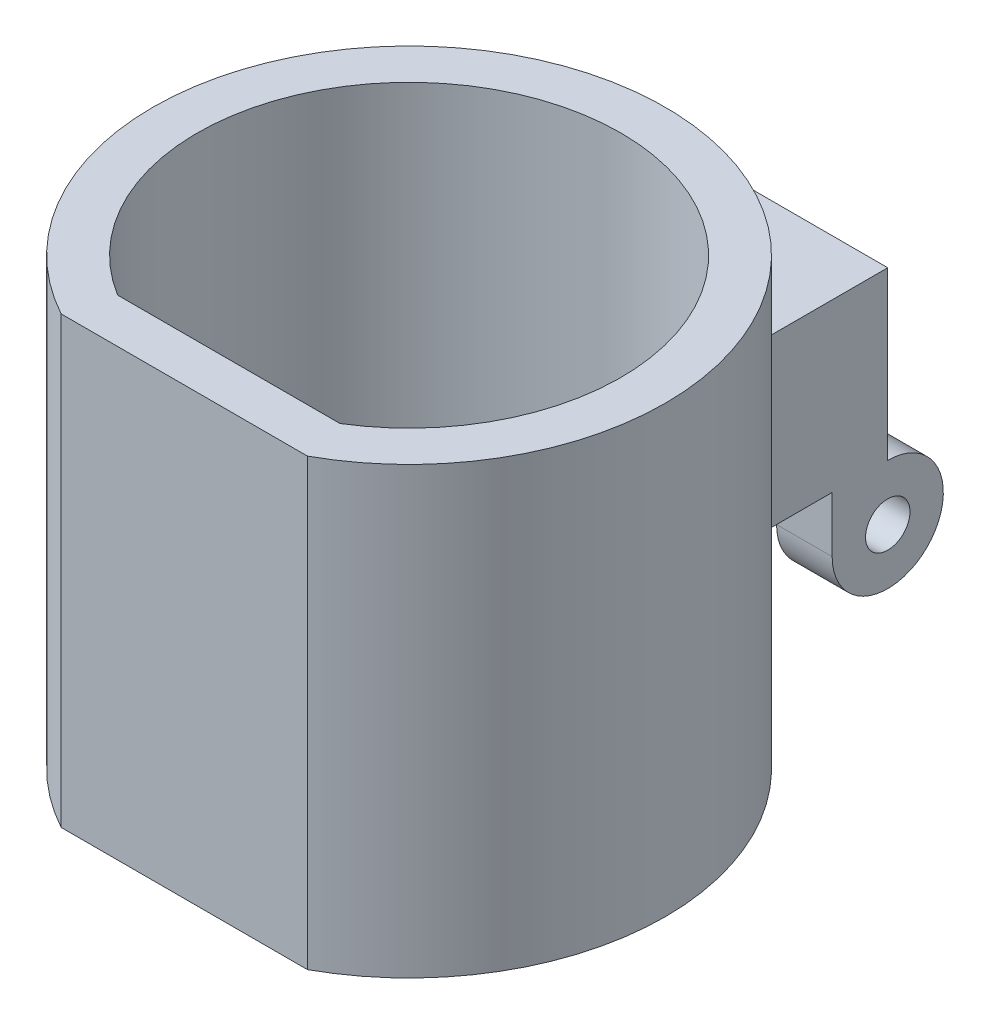
ISO-10303-21;
HEADER;
FILE_DESCRIPTION(('STEP AP214'),'2;1');
FILE_NAME('part.step','',(''),(''),'','','');
FILE_SCHEMA(('AUTOMOTIVE_DESIGN { 1 0 10303 214 1 1 1 1 }'));
ENDSEC;
DATA;
#1=APPLICATION_CONTEXT('core data for automotive mechanical design processes');
#2=APPLICATION_PROTOCOL_DEFINITION('international standard','automotive_design',2000,#1);
#3=PRODUCT_CONTEXT('',#1,'mechanical');
#4=PRODUCT('Part','Part','',(#3));
#5=PRODUCT_RELATED_PRODUCT_CATEGORY('part','',(#4));
#6=PRODUCT_DEFINITION_FORMATION('','',#4);
#7=PRODUCT_DEFINITION_CONTEXT('part definition',#1,'design');
#8=PRODUCT_DEFINITION('design','',#6,#7);
#9=PRODUCT_DEFINITION_SHAPE('','',#8);
#10=(LENGTH_UNIT() NAMED_UNIT(*) SI_UNIT(.MILLI.,.METRE.));
#11=(NAMED_UNIT(*) PLANE_ANGLE_UNIT() SI_UNIT($,.RADIAN.));
#12=(NAMED_UNIT(*) SI_UNIT($,.STERADIAN.) SOLID_ANGLE_UNIT());
#13=UNCERTAINTY_MEASURE_WITH_UNIT(LENGTH_MEASURE(1.E-05),#10,'distance_accuracy_value','');
#14=(GEOMETRIC_REPRESENTATION_CONTEXT(3) GLOBAL_UNCERTAINTY_ASSIGNED_CONTEXT((#13)) GLOBAL_UNIT_ASSIGNED_CONTEXT((#10,
#11,#12)) REPRESENTATION_CONTEXT('',''));
#15=CARTESIAN_POINT('',(0.,0.,0.));
#16=DIRECTION('',(0.,0.,1.));
#17=DIRECTION('',(1.,0.,0.));
#18=AXIS2_PLACEMENT_3D('',#15,#16,#17);
#19=CARTESIAN_POINT('',(10.,-7.5,-33.05));
#20=DIRECTION('',(0.,1.,0.));
#21=DIRECTION('',(0.,0.,1.));
#22=AXIS2_PLACEMENT_3D('',#19,#20,#21);
#23=PLANE('',#22);
#24=DIRECTION('',(0.,0.,1.));
#25=VECTOR('',#24,1.);
#26=CARTESIAN_POINT('',(-5.,-7.5,-28.05));
#27=LINE('',#26,#25);
#28=CARTESIAN_POINT('',(-5.,-7.5,-33.05));
#29=VERTEX_POINT('',#28);
#30=CARTESIAN_POINT('',(-5.,-7.5,-28.05));
#31=VERTEX_POINT('',#30);
#32=EDGE_CURVE('E140',#29,#31,#27,.T.);
#33=ORIENTED_EDGE('',*,*,#32,.F.);
#34=DIRECTION('',(-1.,0.,0.));
#35=VECTOR('',#34,1.);
#36=CARTESIAN_POINT('',(10.,-7.5,-33.05));
#37=LINE('',#36,#35);
#38=CARTESIAN_POINT('',(5.,-7.5,-33.05));
#39=VERTEX_POINT('',#38);
#40=EDGE_CURVE('E210',#39,#29,#37,.T.);
#41=ORIENTED_EDGE('',*,*,#40,.F.);
#42=DIRECTION('',(0.,0.,1.));
#43=VECTOR('',#42,1.);
#44=CARTESIAN_POINT('',(5.,-7.5,-28.05));
#45=LINE('',#44,#43);
#46=CARTESIAN_POINT('',(5.,-7.5,-28.05));
#47=VERTEX_POINT('',#46);
#48=EDGE_CURVE('E176',#39,#47,#45,.T.);
#49=ORIENTED_EDGE('',*,*,#48,.T.);
#50=DIRECTION('',(1.,0.,0.));
#51=VECTOR('',#50,1.);
#52=CARTESIAN_POINT('',(5.,-7.5,-28.05));
#53=LINE('',#52,#51);
#54=CARTESIAN_POINT('',(10.,-7.5,-28.05));
#55=VERTEX_POINT('',#54);
#56=EDGE_CURVE('E183',#47,#55,#53,.T.);
#57=ORIENTED_EDGE('',*,*,#56,.T.);
#58=DIRECTION('',(0.,0.,1.));
#59=VECTOR('',#58,1.);
#60=CARTESIAN_POINT('',(10.,-7.5,-33.05));
#61=LINE('',#60,#59);
#62=CARTESIAN_POINT('',(10.,-7.5,-20.7678236702838));
#63=VERTEX_POINT('',#62);
#64=EDGE_CURVE('E216',#55,#63,#61,.T.);
#65=ORIENTED_EDGE('',*,*,#64,.T.);
#66=CARTESIAN_POINT('',(0.,-7.5,0.));
#67=DIRECTION('',(0.,-1.,0.));
#68=DIRECTION('',(0.,0.,-1.));
#69=AXIS2_PLACEMENT_3D('',#66,#67,#68);
#70=CIRCLE('',#69,23.05);
#71=CARTESIAN_POINT('',(-10.,-7.5,-20.7678236702838));
#72=VERTEX_POINT('',#71);
#73=EDGE_CURVE('E195',#63,#72,#70,.F.);
#74=ORIENTED_EDGE('',*,*,#73,.T.);
#75=DIRECTION('',(0.,0.,1.));
#76=VECTOR('',#75,1.);
#77=CARTESIAN_POINT('',(-10.,-7.5,-33.05));
#78=LINE('',#77,#76);
#79=CARTESIAN_POINT('',(-10.,-7.5,-28.05));
#80=VERTEX_POINT('',#79);
#81=EDGE_CURVE('E214',#80,#72,#78,.T.);
#82=ORIENTED_EDGE('',*,*,#81,.F.);
#83=DIRECTION('',(-1.,0.,0.));
#84=VECTOR('',#83,1.);
#85=CARTESIAN_POINT('',(-5.,-7.5,-28.05));
#86=LINE('',#85,#84);
#87=EDGE_CURVE('E151',#31,#80,#86,.T.);
#88=ORIENTED_EDGE('',*,*,#87,.F.);
#89=EDGE_LOOP('',(#33,#41,#49,#57,#65,#74,#82,#88));
#90=FACE_BOUND('',#89,.T.);
#91=ADVANCED_FACE('F37',(#90),#23,.F.);
#92=CARTESIAN_POINT('',(0.,20.,0.));
#93=DIRECTION('',(0.,-1.,0.));
#94=DIRECTION('',(0.,0.,-1.));
#95=AXIS2_PLACEMENT_3D('',#92,#93,#94);
#96=CYLINDRICAL_SURFACE('',#95,23.05);
#97=CARTESIAN_POINT('',(0.,-20.,0.));
#98=DIRECTION('',(0.,1.,0.));
#99=DIRECTION('',(0.,0.,1.));
#100=AXIS2_PLACEMENT_3D('',#97,#98,#99);
#101=CIRCLE('',#100,23.05);
#102=CARTESIAN_POINT('',(11.076364599346,-20.,20.2142684077944));
#103=VERTEX_POINT('',#102);
#104=CARTESIAN_POINT('',(-11.076364599346,-20.,20.2142684077944));
#105=VERTEX_POINT('',#104);
#106=EDGE_CURVE('E240',#103,#105,#101,.T.);
#107=ORIENTED_EDGE('',*,*,#106,.T.);
#108=DIRECTION('',(0.,-1.,0.));
#109=VECTOR('',#108,1.);
#110=CARTESIAN_POINT('',(-11.076364599346,20.,20.2142684077944));
#111=LINE('',#110,#109);
#112=CARTESIAN_POINT('',(-11.076364599346,20.,20.2142684077944));
#113=VERTEX_POINT('',#112);
#114=EDGE_CURVE('E11',#113,#105,#111,.T.);
#115=ORIENTED_EDGE('',*,*,#114,.F.);
#116=CARTESIAN_POINT('',(0.,20.,0.));
#117=DIRECTION('',(0.,1.,0.));
#118=DIRECTION('',(0.,0.,1.));
#119=AXIS2_PLACEMENT_3D('',#116,#117,#118);
#120=CIRCLE('',#119,23.05);
#121=CARTESIAN_POINT('',(11.076364599346,20.,20.2142684077944));
#122=VERTEX_POINT('',#121);
#123=EDGE_CURVE('E241',#122,#113,#120,.T.);
#124=ORIENTED_EDGE('',*,*,#123,.F.);
#125=DIRECTION('',(0.,-1.,0.));
#126=VECTOR('',#125,1.);
#127=CARTESIAN_POINT('',(11.076364599346,20.,20.2142684077944));
#128=LINE('',#127,#126);
#129=EDGE_CURVE('E45',#122,#103,#128,.T.);
#130=ORIENTED_EDGE('',*,*,#129,.T.);
#131=EDGE_LOOP('',(#107,#115,#124,#130));
#132=FACE_BOUND('',#131,.T.);
#133=DIRECTION('',(0.,-1.,0.));
#134=VECTOR('',#133,1.);
#135=CARTESIAN_POINT('',(-10.,20.,-20.7678236702838));
#136=LINE('',#135,#134);
#137=CARTESIAN_POINT('',(-10.,7.5,-20.7678236702838));
#138=VERTEX_POINT('',#137);
#139=EDGE_CURVE('E190',#72,#138,#136,.F.);
#140=ORIENTED_EDGE('',*,*,#139,.F.);
#141=ORIENTED_EDGE('',*,*,#73,.F.);
#142=DIRECTION('',(0.,-1.,0.));
#143=VECTOR('',#142,1.);
#144=CARTESIAN_POINT('',(10.,20.,-20.7678236702838));
#145=LINE('',#144,#143);
#146=CARTESIAN_POINT('',(10.,7.5,-20.7678236702838));
#147=VERTEX_POINT('',#146);
#148=EDGE_CURVE('E199',#147,#63,#145,.T.);
#149=ORIENTED_EDGE('',*,*,#148,.F.);
#150=CARTESIAN_POINT('',(0.,7.5,0.));
#151=DIRECTION('',(0.,1.,0.));
#152=DIRECTION('',(0.,0.,1.));
#153=AXIS2_PLACEMENT_3D('',#150,#151,#152);
#154=CIRCLE('',#153,23.05);
#155=EDGE_CURVE('E60',#138,#147,#154,.F.);
#156=ORIENTED_EDGE('',*,*,#155,.F.);
#157=EDGE_LOOP('',(#140,#141,#149,#156));
#158=FACE_BOUND('',#157,.T.);
#159=ADVANCED_FACE('F39',(#132,#158),#96,.T.);
#160=CARTESIAN_POINT('',(0.,20.,0.));
#161=DIRECTION('',(0.,1.,0.));
#162=DIRECTION('',(0.,0.,1.));
#163=AXIS2_PLACEMENT_3D('',#160,#161,#162);
#164=PLANE('',#163);
#165=ORIENTED_EDGE('',*,*,#123,.T.);
#166=DIRECTION('',(1.,0.,0.));
#167=VECTOR('',#166,1.);
#168=CARTESIAN_POINT('',(-11.076364599346,20.,20.2142684077944));
#169=LINE('',#168,#167);
#170=EDGE_CURVE('E244',#113,#122,#169,.T.);
#171=ORIENTED_EDGE('',*,*,#170,.T.);
#172=EDGE_LOOP('',(#165,#171));
#173=FACE_BOUND('',#172,.T.);
#174=DIRECTION('',(1.,0.,0.));
#175=VECTOR('',#174,1.);
#176=CARTESIAN_POINT('',(-10.,20.,16.2142684077944));
#177=LINE('',#176,#175);
#178=CARTESIAN_POINT('',(-10.,20.,16.2142684077944));
#179=VERTEX_POINT('',#178);
#180=CARTESIAN_POINT('',(10.,20.,16.2142684077944));
#181=VERTEX_POINT('',#180);
#182=EDGE_CURVE('E227',#179,#181,#177,.T.);
#183=ORIENTED_EDGE('',*,*,#182,.F.);
#184=CARTESIAN_POINT('',(0.,20.,0.));
#185=DIRECTION('',(0.,1.,0.));
#186=DIRECTION('',(0.,0.,1.));
#187=AXIS2_PLACEMENT_3D('',#184,#185,#186);
#188=CIRCLE('',#187,19.05);
#189=EDGE_CURVE('E224',#181,#179,#188,.T.);
#190=ORIENTED_EDGE('',*,*,#189,.F.);
#191=EDGE_LOOP('',(#183,#190));
#192=FACE_BOUND('',#191,.T.);
#193=ADVANCED_FACE('F261',(#173,#192),#164,.T.);
#194=CARTESIAN_POINT('',(0.,-20.,0.));
#195=DIRECTION('',(0.,1.,0.));
#196=DIRECTION('',(0.,0.,1.));
#197=AXIS2_PLACEMENT_3D('',#194,#195,#196);
#198=PLANE('',#197);
#199=ORIENTED_EDGE('',*,*,#106,.F.);
#200=DIRECTION('',(1.,0.,0.));
#201=VECTOR('',#200,1.);
#202=CARTESIAN_POINT('',(-11.076364599346,-20.,20.2142684077944));
#203=LINE('',#202,#201);
#204=EDGE_CURVE('E245',#105,#103,#203,.T.);
#205=ORIENTED_EDGE('',*,*,#204,.F.);
#206=EDGE_LOOP('',(#199,#205));
#207=FACE_BOUND('',#206,.T.);
#208=CARTESIAN_POINT('',(0.,-20.,0.));
#209=DIRECTION('',(0.,1.,0.));
#210=DIRECTION('',(0.,0.,1.));
#211=AXIS2_PLACEMENT_3D('',#208,#209,#210);
#212=CIRCLE('',#211,19.05);
#213=CARTESIAN_POINT('',(10.,-20.,16.2142684077944));
#214=VERTEX_POINT('',#213);
#215=CARTESIAN_POINT('',(-10.,-20.,16.2142684077944));
#216=VERTEX_POINT('',#215);
#217=EDGE_CURVE('E223',#214,#216,#212,.T.);
#218=ORIENTED_EDGE('',*,*,#217,.T.);
#219=DIRECTION('',(1.,0.,0.));
#220=VECTOR('',#219,1.);
#221=CARTESIAN_POINT('',(-10.,-20.,16.2142684077944));
#222=LINE('',#221,#220);
#223=EDGE_CURVE('E228',#216,#214,#222,.T.);
#224=ORIENTED_EDGE('',*,*,#223,.T.);
#225=EDGE_LOOP('',(#218,#224));
#226=FACE_BOUND('',#225,.T.);
#227=ADVANCED_FACE('F257',(#207,#226),#198,.F.);
#228=CARTESIAN_POINT('',(-11.076364599346,20.,20.2142684077944));
#229=DIRECTION('',(0.,0.,-1.));
#230=DIRECTION('',(-1.,0.,0.));
#231=AXIS2_PLACEMENT_3D('',#228,#229,#230);
#232=PLANE('',#231);
#233=ORIENTED_EDGE('',*,*,#204,.T.);
#234=ORIENTED_EDGE('',*,*,#129,.F.);
#235=ORIENTED_EDGE('',*,*,#170,.F.);
#236=ORIENTED_EDGE('',*,*,#114,.T.);
#237=EDGE_LOOP('',(#233,#234,#235,#236));
#238=FACE_BOUND('',#237,.T.);
#239=ADVANCED_FACE('F259',(#238),#232,.F.);
#240=CARTESIAN_POINT('',(0.,20.,0.));
#241=DIRECTION('',(0.,-1.,0.));
#242=DIRECTION('',(0.,0.,-1.));
#243=AXIS2_PLACEMENT_3D('',#240,#241,#242);
#244=CYLINDRICAL_SURFACE('',#243,19.05);
#245=ORIENTED_EDGE('',*,*,#217,.F.);
#246=DIRECTION('',(0.,-1.,0.));
#247=VECTOR('',#246,1.);
#248=CARTESIAN_POINT('',(10.,20.,16.2142684077944));
#249=LINE('',#248,#247);
#250=EDGE_CURVE('E230',#181,#214,#249,.T.);
#251=ORIENTED_EDGE('',*,*,#250,.F.);
#252=ORIENTED_EDGE('',*,*,#189,.T.);
#253=DIRECTION('',(0.,-1.,0.));
#254=VECTOR('',#253,1.);
#255=CARTESIAN_POINT('',(-10.,20.,16.2142684077944));
#256=LINE('',#255,#254);
#257=EDGE_CURVE('E237',#179,#216,#256,.T.);
#258=ORIENTED_EDGE('',*,*,#257,.T.);
#259=EDGE_LOOP('',(#245,#251,#252,#258));
#260=FACE_BOUND('',#259,.T.);
#261=ADVANCED_FACE('F271',(#260),#244,.F.);
#262=CARTESIAN_POINT('',(-10.,20.,16.2142684077944));
#263=DIRECTION('',(0.,0.,-1.));
#264=DIRECTION('',(-1.,0.,0.));
#265=AXIS2_PLACEMENT_3D('',#262,#263,#264);
#266=PLANE('',#265);
#267=ORIENTED_EDGE('',*,*,#223,.F.);
#268=ORIENTED_EDGE('',*,*,#257,.F.);
#269=ORIENTED_EDGE('',*,*,#182,.T.);
#270=ORIENTED_EDGE('',*,*,#250,.T.);
#271=EDGE_LOOP('',(#267,#268,#269,#270));
#272=FACE_BOUND('',#271,.T.);
#273=ADVANCED_FACE('F269',(#272),#266,.T.);
#274=CARTESIAN_POINT('',(-10.,-7.5,-33.05));
#275=DIRECTION('',(1.,0.,0.));
#276=DIRECTION('',(0.,0.,-1.));
#277=AXIS2_PLACEMENT_3D('',#274,#275,#276);
#278=PLANE('',#277);
#279=DIRECTION('',(0.,1.,0.));
#280=VECTOR('',#279,1.);
#281=CARTESIAN_POINT('',(-10.,-7.5,-33.05));
#282=LINE('',#281,#280);
#283=CARTESIAN_POINT('',(-10.,-7.5,-33.05));
#284=VERTEX_POINT('',#283);
#285=CARTESIAN_POINT('',(-10.,7.5,-33.05));
#286=VERTEX_POINT('',#285);
#287=EDGE_CURVE('E198',#284,#286,#282,.T.);
#288=ORIENTED_EDGE('',*,*,#287,.F.);
#289=CARTESIAN_POINT('',(-10.,-12.5,-33.05));
#290=DIRECTION('',(1.,0.,0.));
#291=DIRECTION('',(0.,0.,-1.));
#292=AXIS2_PLACEMENT_3D('',#289,#290,#291);
#293=CIRCLE('',#292,5.);
#294=CARTESIAN_POINT('',(-10.,-12.5,-28.05));
#295=VERTEX_POINT('',#294);
#296=EDGE_CURVE('E157',#295,#284,#293,.T.);
#297=ORIENTED_EDGE('',*,*,#296,.F.);
#298=DIRECTION('',(0.,-1.,0.));
#299=VECTOR('',#298,1.);
#300=CARTESIAN_POINT('',(-10.,-12.5,-28.05));
#301=LINE('',#300,#299);
#302=EDGE_CURVE('E148',#80,#295,#301,.T.);
#303=ORIENTED_EDGE('',*,*,#302,.F.);
#304=ORIENTED_EDGE('',*,*,#81,.T.);
#305=ORIENTED_EDGE('',*,*,#139,.T.);
#306=DIRECTION('',(0.,0.,1.));
#307=VECTOR('',#306,1.);
#308=CARTESIAN_POINT('',(-10.,7.5,-33.05));
#309=LINE('',#308,#307);
#310=EDGE_CURVE('E221',#286,#138,#309,.T.);
#311=ORIENTED_EDGE('',*,*,#310,.F.);
#312=EDGE_LOOP('',(#288,#297,#303,#304,#305,#311));
#313=FACE_BOUND('',#312,.T.);
#314=CARTESIAN_POINT('',(-10.,-12.5,-33.05));
#315=DIRECTION('',(1.,0.,0.));
#316=DIRECTION('',(0.,0.,-1.));
#317=AXIS2_PLACEMENT_3D('',#314,#315,#316);
#318=CIRCLE('',#317,2.);
#319=CARTESIAN_POINT('',(-10.,-12.5,-35.05));
#320=VERTEX_POINT('',#319);
#321=EDGE_CURVE('E160',#320,#320,#318,.T.);
#322=ORIENTED_EDGE('',*,*,#321,.T.);
#323=EDGE_LOOP('',(#322));
#324=FACE_BOUND('',#323,.T.);
#325=ADVANCED_FACE('F294',(#313,#324),#278,.F.);
#326=CARTESIAN_POINT('',(10.,7.5,-33.05));
#327=DIRECTION('',(0.,-1.,0.));
#328=DIRECTION('',(0.,0.,-1.));
#329=AXIS2_PLACEMENT_3D('',#326,#327,#328);
#330=PLANE('',#329);
#331=ORIENTED_EDGE('',*,*,#310,.T.);
#332=ORIENTED_EDGE('',*,*,#155,.T.);
#333=DIRECTION('',(0.,0.,1.));
#334=VECTOR('',#333,1.);
#335=CARTESIAN_POINT('',(10.,7.5,-33.05));
#336=LINE('',#335,#334);
#337=CARTESIAN_POINT('',(10.,7.5,-33.05));
#338=VERTEX_POINT('',#337);
#339=EDGE_CURVE('E218',#338,#147,#336,.T.);
#340=ORIENTED_EDGE('',*,*,#339,.F.);
#341=DIRECTION('',(1.,0.,0.));
#342=VECTOR('',#341,1.);
#343=CARTESIAN_POINT('',(10.,7.5,-33.05));
#344=LINE('',#343,#342);
#345=EDGE_CURVE('E205',#286,#338,#344,.T.);
#346=ORIENTED_EDGE('',*,*,#345,.F.);
#347=EDGE_LOOP('',(#331,#332,#340,#346));
#348=FACE_BOUND('',#347,.T.);
#349=ADVANCED_FACE('F290',(#348),#330,.F.);
#350=CARTESIAN_POINT('',(10.,-7.5,-33.05));
#351=DIRECTION('',(-1.,0.,0.));
#352=DIRECTION('',(0.,0.,1.));
#353=AXIS2_PLACEMENT_3D('',#350,#351,#352);
#354=PLANE('',#353);
#355=ORIENTED_EDGE('',*,*,#339,.T.);
#356=ORIENTED_EDGE('',*,*,#148,.T.);
#357=ORIENTED_EDGE('',*,*,#64,.F.);
#358=DIRECTION('',(0.,-1.,0.));
#359=VECTOR('',#358,1.);
#360=CARTESIAN_POINT('',(10.,-12.5,-28.05));
#361=LINE('',#360,#359);
#362=CARTESIAN_POINT('',(10.,-12.5,-28.05));
#363=VERTEX_POINT('',#362);
#364=EDGE_CURVE('E177',#55,#363,#361,.T.);
#365=ORIENTED_EDGE('',*,*,#364,.T.);
#366=CARTESIAN_POINT('',(10.,-12.5,-33.05));
#367=DIRECTION('',(1.,0.,0.));
#368=DIRECTION('',(0.,0.,-1.));
#369=AXIS2_PLACEMENT_3D('',#366,#367,#368);
#370=CIRCLE('',#369,5.);
#371=CARTESIAN_POINT('',(10.,-7.5,-33.05));
#372=VERTEX_POINT('',#371);
#373=EDGE_CURVE('E172',#363,#372,#370,.T.);
#374=ORIENTED_EDGE('',*,*,#373,.T.);
#375=DIRECTION('',(0.,-1.,0.));
#376=VECTOR('',#375,1.);
#377=CARTESIAN_POINT('',(10.,-7.5,-33.05));
#378=LINE('',#377,#376);
#379=EDGE_CURVE('E207',#338,#372,#378,.T.);
#380=ORIENTED_EDGE('',*,*,#379,.F.);
#381=EDGE_LOOP('',(#355,#356,#357,#365,#374,#380));
#382=FACE_BOUND('',#381,.T.);
#383=CARTESIAN_POINT('',(10.,-12.5,-33.05));
#384=DIRECTION('',(1.,0.,0.));
#385=DIRECTION('',(0.,0.,-1.));
#386=AXIS2_PLACEMENT_3D('',#383,#384,#385);
#387=CIRCLE('',#386,2.);
#388=CARTESIAN_POINT('',(10.,-12.5,-35.05));
#389=VERTEX_POINT('',#388);
#390=EDGE_CURVE('E167',#389,#389,#387,.T.);
#391=ORIENTED_EDGE('',*,*,#390,.F.);
#392=EDGE_LOOP('',(#391));
#393=FACE_BOUND('',#392,.T.);
#394=ADVANCED_FACE('F287',(#382,#393),#354,.F.);
#395=CARTESIAN_POINT('',(0.,0.,-33.05));
#396=DIRECTION('',(0.,0.,1.));
#397=DIRECTION('',(1.,0.,0.));
#398=AXIS2_PLACEMENT_3D('',#395,#396,#397);
#399=PLANE('',#398);
#400=ORIENTED_EDGE('',*,*,#287,.T.);
#401=ORIENTED_EDGE('',*,*,#345,.T.);
#402=ORIENTED_EDGE('',*,*,#379,.T.);
#403=EDGE_CURVE('E211',#372,#39,#37,.T.);
#404=ORIENTED_EDGE('',*,*,#403,.T.);
#405=ORIENTED_EDGE('',*,*,#40,.T.);
#406=DIRECTION('',(-1.,0.,0.));
#407=VECTOR('',#406,1.);
#408=CARTESIAN_POINT('',(-5.,-7.5,-33.05));
#409=LINE('',#408,#407);
#410=EDGE_CURVE('E155',#29,#284,#409,.T.);
#411=ORIENTED_EDGE('',*,*,#410,.T.);
#412=EDGE_LOOP('',(#400,#401,#402,#404,#405,#411));
#413=FACE_BOUND('',#412,.T.);
#414=ADVANCED_FACE('F285',(#413),#399,.F.);
#415=CARTESIAN_POINT('',(5.,-12.5,-33.05));
#416=DIRECTION('',(1.,0.,0.));
#417=DIRECTION('',(0.,0.,-1.));
#418=AXIS2_PLACEMENT_3D('',#415,#416,#417);
#419=CYLINDRICAL_SURFACE('',#418,5.);
#420=ORIENTED_EDGE('',*,*,#373,.F.);
#421=DIRECTION('',(1.,0.,0.));
#422=VECTOR('',#421,1.);
#423=CARTESIAN_POINT('',(5.,-12.5,-28.05));
#424=LINE('',#423,#422);
#425=CARTESIAN_POINT('',(5.,-12.5,-28.05));
#426=VERTEX_POINT('',#425);
#427=EDGE_CURVE('E188',#426,#363,#424,.T.);
#428=ORIENTED_EDGE('',*,*,#427,.F.);
#429=CARTESIAN_POINT('',(5.,-12.5,-33.05));
#430=DIRECTION('',(1.,0.,0.));
#431=DIRECTION('',(0.,0.,-1.));
#432=AXIS2_PLACEMENT_3D('',#429,#430,#431);
#433=CIRCLE('',#432,5.);
#434=EDGE_CURVE('E52',#426,#39,#433,.T.);
#435=ORIENTED_EDGE('',*,*,#434,.T.);
#436=ORIENTED_EDGE('',*,*,#403,.F.);
#437=EDGE_LOOP('',(#420,#428,#435,#436));
#438=FACE_BOUND('',#437,.T.);
#439=ADVANCED_FACE('F330',(#438),#419,.T.);
#440=CARTESIAN_POINT('',(5.,-12.5,-28.05));
#441=DIRECTION('',(0.,0.,1.));
#442=DIRECTION('',(1.,0.,0.));
#443=AXIS2_PLACEMENT_3D('',#440,#441,#442);
#444=PLANE('',#443);
#445=ORIENTED_EDGE('',*,*,#364,.F.);
#446=ORIENTED_EDGE('',*,*,#56,.F.);
#447=DIRECTION('',(0.,-1.,0.));
#448=VECTOR('',#447,1.);
#449=CARTESIAN_POINT('',(5.,-12.5,-28.05));
#450=LINE('',#449,#448);
#451=EDGE_CURVE('E180',#47,#426,#450,.T.);
#452=ORIENTED_EDGE('',*,*,#451,.T.);
#453=ORIENTED_EDGE('',*,*,#427,.T.);
#454=EDGE_LOOP('',(#445,#446,#452,#453));
#455=FACE_BOUND('',#454,.T.);
#456=ADVANCED_FACE('F337',(#455),#444,.T.);
#457=CARTESIAN_POINT('',(5.,-12.5,-33.05));
#458=DIRECTION('',(1.,0.,0.));
#459=DIRECTION('',(0.,0.,-1.));
#460=AXIS2_PLACEMENT_3D('',#457,#458,#459);
#461=PLANE('',#460);
#462=CARTESIAN_POINT('',(5.,-12.5,-33.05));
#463=DIRECTION('',(1.,0.,0.));
#464=DIRECTION('',(0.,0.,-1.));
#465=AXIS2_PLACEMENT_3D('',#462,#463,#464);
#466=CIRCLE('',#465,2.);
#467=CARTESIAN_POINT('',(5.,-12.5,-35.05));
#468=VERTEX_POINT('',#467);
#469=EDGE_CURVE('E169',#468,#468,#466,.T.);
#470=ORIENTED_EDGE('',*,*,#469,.T.);
#471=EDGE_LOOP('',(#470));
#472=FACE_BOUND('',#471,.T.);
#473=ORIENTED_EDGE('',*,*,#434,.F.);
#474=ORIENTED_EDGE('',*,*,#451,.F.);
#475=ORIENTED_EDGE('',*,*,#48,.F.);
#476=EDGE_LOOP('',(#473,#474,#475));
#477=FACE_BOUND('',#476,.T.);
#478=ADVANCED_FACE('F343',(#472,#477),#461,.F.);
#479=CARTESIAN_POINT('',(5.,-12.5,-33.05));
#480=DIRECTION('',(1.,0.,0.));
#481=DIRECTION('',(0.,0.,-1.));
#482=AXIS2_PLACEMENT_3D('',#479,#480,#481);
#483=CYLINDRICAL_SURFACE('',#482,2.);
#484=ORIENTED_EDGE('',*,*,#469,.F.);
#485=EDGE_LOOP('',(#484));
#486=FACE_BOUND('',#485,.T.);
#487=ORIENTED_EDGE('',*,*,#390,.T.);
#488=EDGE_LOOP('',(#487));
#489=FACE_BOUND('',#488,.T.);
#490=ADVANCED_FACE('F351',(#486,#489),#483,.F.);
#491=CARTESIAN_POINT('',(-5.,-12.5,-33.05));
#492=DIRECTION('',(-1.,0.,0.));
#493=DIRECTION('',(0.,0.,-1.));
#494=AXIS2_PLACEMENT_3D('',#491,#492,#493);
#495=PLANE('',#494);
#496=CARTESIAN_POINT('',(-5.,-12.5,-33.05));
#497=DIRECTION('',(1.,0.,0.));
#498=DIRECTION('',(0.,0.,-1.));
#499=AXIS2_PLACEMENT_3D('',#496,#497,#498);
#500=CIRCLE('',#499,5.);
#501=CARTESIAN_POINT('',(-5.,-12.5,-28.05));
#502=VERTEX_POINT('',#501);
#503=EDGE_CURVE('E137',#502,#29,#500,.T.);
#504=ORIENTED_EDGE('',*,*,#503,.T.);
#505=ORIENTED_EDGE('',*,*,#32,.T.);
#506=DIRECTION('',(0.,-1.,0.));
#507=VECTOR('',#506,1.);
#508=CARTESIAN_POINT('',(-5.,-12.5,-28.05));
#509=LINE('',#508,#507);
#510=EDGE_CURVE('E132',#31,#502,#509,.T.);
#511=ORIENTED_EDGE('',*,*,#510,.T.);
#512=EDGE_LOOP('',(#504,#505,#511));
#513=FACE_BOUND('',#512,.T.);
#514=CARTESIAN_POINT('',(-5.,-12.5,-33.05));
#515=DIRECTION('',(1.,0.,0.));
#516=DIRECTION('',(0.,0.,-1.));
#517=AXIS2_PLACEMENT_3D('',#514,#515,#516);
#518=CIRCLE('',#517,2.);
#519=CARTESIAN_POINT('',(-5.,-12.5,-35.05));
#520=VERTEX_POINT('',#519);
#521=EDGE_CURVE('E164',#520,#520,#518,.T.);
#522=ORIENTED_EDGE('',*,*,#521,.F.);
#523=EDGE_LOOP('',(#522));
#524=FACE_BOUND('',#523,.T.);
#525=ADVANCED_FACE('F134',(#513,#524),#495,.F.);
#526=CARTESIAN_POINT('',(-5.,-12.5,-33.05));
#527=DIRECTION('',(-1.,0.,0.));
#528=DIRECTION('',(0.,0.,1.));
#529=AXIS2_PLACEMENT_3D('',#526,#527,#528);
#530=CYLINDRICAL_SURFACE('',#529,5.);
#531=ORIENTED_EDGE('',*,*,#296,.T.);
#532=ORIENTED_EDGE('',*,*,#410,.F.);
#533=ORIENTED_EDGE('',*,*,#503,.F.);
#534=DIRECTION('',(-1.,0.,0.));
#535=VECTOR('',#534,1.);
#536=CARTESIAN_POINT('',(-5.,-12.5,-28.05));
#537=LINE('',#536,#535);
#538=EDGE_CURVE('E145',#502,#295,#537,.T.);
#539=ORIENTED_EDGE('',*,*,#538,.T.);
#540=EDGE_LOOP('',(#531,#532,#533,#539));
#541=FACE_BOUND('',#540,.T.);
#542=ADVANCED_FACE('F153',(#541),#530,.T.);
#543=CARTESIAN_POINT('',(-5.,-12.5,-28.05));
#544=DIRECTION('',(0.,0.,-1.));
#545=DIRECTION('',(-1.,0.,0.));
#546=AXIS2_PLACEMENT_3D('',#543,#544,#545);
#547=PLANE('',#546);
#548=ORIENTED_EDGE('',*,*,#302,.T.);
#549=ORIENTED_EDGE('',*,*,#538,.F.);
#550=ORIENTED_EDGE('',*,*,#510,.F.);
#551=ORIENTED_EDGE('',*,*,#87,.T.);
#552=EDGE_LOOP('',(#548,#549,#550,#551));
#553=FACE_BOUND('',#552,.T.);
#554=ADVANCED_FACE('F146',(#553),#547,.F.);
#555=CARTESIAN_POINT('',(-5.,-12.5,-33.05));
#556=DIRECTION('',(-1.,0.,0.));
#557=DIRECTION('',(0.,0.,1.));
#558=AXIS2_PLACEMENT_3D('',#555,#556,#557);
#559=CYLINDRICAL_SURFACE('',#558,2.);
#560=ORIENTED_EDGE('',*,*,#521,.T.);
#561=EDGE_LOOP('',(#560));
#562=FACE_BOUND('',#561,.T.);
#563=ORIENTED_EDGE('',*,*,#321,.F.);
#564=EDGE_LOOP('',(#563));
#565=FACE_BOUND('',#564,.T.);
#566=ADVANCED_FACE('F377',(#562,#565),#559,.F.);
#567=CLOSED_SHELL('',(#91,#159,#193,#227,#239,#261,#273,#325,#349,#394,#414,#439,#456,#478,#490,
#525,#542,#554,#566));
#568=MANIFOLD_SOLID_BREP('B2',#567);
#569=ADVANCED_BREP_SHAPE_REPRESENTATION('',(#18,#568),#14);
#570=SHAPE_DEFINITION_REPRESENTATION(#9,#569);
ENDSEC;
END-ISO-10303-21;
